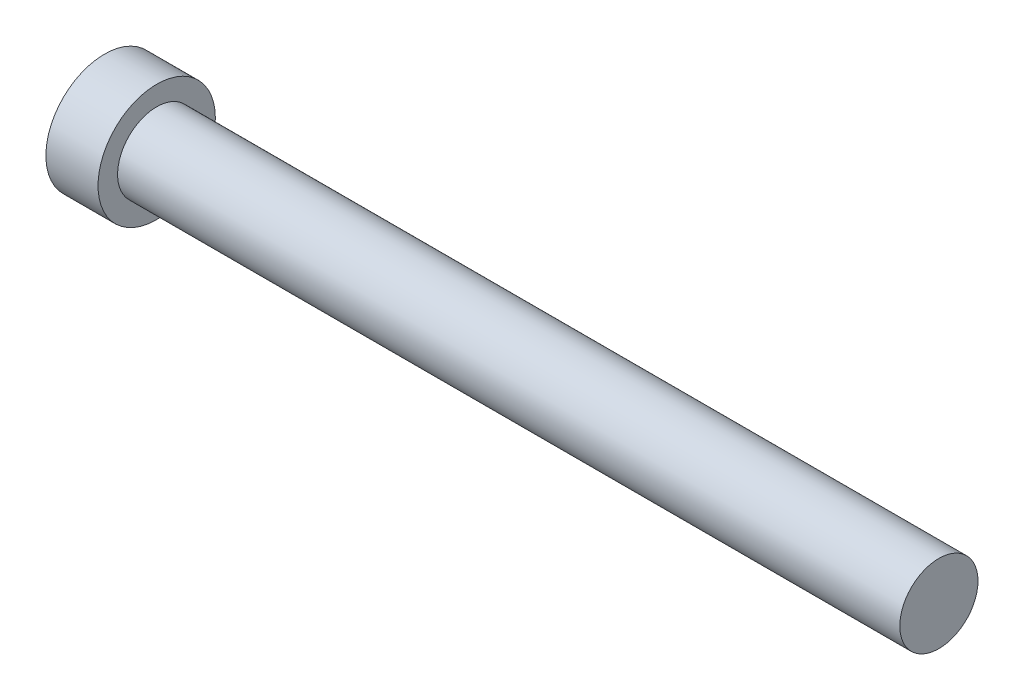
ISO-10303-21;
HEADER;
FILE_DESCRIPTION(('STEP AP214'),'2;1');
FILE_NAME('part.step','',(''),(''),'','','');
FILE_SCHEMA(('AUTOMOTIVE_DESIGN { 1 0 10303 214 1 1 1 1 }'));
ENDSEC;
DATA;
#1=APPLICATION_CONTEXT('core data for automotive mechanical design processes');
#2=APPLICATION_PROTOCOL_DEFINITION('international standard','automotive_design',2000,#1);
#3=PRODUCT_CONTEXT('',#1,'mechanical');
#4=PRODUCT('Part','Part','',(#3));
#5=PRODUCT_RELATED_PRODUCT_CATEGORY('part','',(#4));
#6=PRODUCT_DEFINITION_FORMATION('','',#4);
#7=PRODUCT_DEFINITION_CONTEXT('part definition',#1,'design');
#8=PRODUCT_DEFINITION('design','',#6,#7);
#9=PRODUCT_DEFINITION_SHAPE('','',#8);
#10=(LENGTH_UNIT() NAMED_UNIT(*) SI_UNIT(.MILLI.,.METRE.));
#11=(NAMED_UNIT(*) PLANE_ANGLE_UNIT() SI_UNIT($,.RADIAN.));
#12=(NAMED_UNIT(*) SI_UNIT($,.STERADIAN.) SOLID_ANGLE_UNIT());
#13=UNCERTAINTY_MEASURE_WITH_UNIT(LENGTH_MEASURE(1.E-05),#10,'distance_accuracy_value','');
#14=(GEOMETRIC_REPRESENTATION_CONTEXT(3) GLOBAL_UNCERTAINTY_ASSIGNED_CONTEXT((#13)) GLOBAL_UNIT_ASSIGNED_CONTEXT((#10,
#11,#12)) REPRESENTATION_CONTEXT('',''));
#15=CARTESIAN_POINT('',(0.,0.,0.));
#16=DIRECTION('',(0.,0.,1.));
#17=DIRECTION('',(1.,0.,0.));
#18=AXIS2_PLACEMENT_3D('',#15,#16,#17);
#19=CARTESIAN_POINT('',(2.,0.,0.));
#20=DIRECTION('',(-1.,0.,0.));
#21=DIRECTION('',(0.,0.,1.));
#22=AXIS2_PLACEMENT_3D('',#19,#20,#21);
#23=CYLINDRICAL_SURFACE('',#22,2.25);
#24=CARTESIAN_POINT('',(2.,0.,0.));
#25=DIRECTION('',(1.,0.,0.));
#26=DIRECTION('',(0.,0.,-1.));
#27=AXIS2_PLACEMENT_3D('',#24,#25,#26);
#28=CIRCLE('',#27,2.25);
#29=CARTESIAN_POINT('',(2.,0.,-2.25));
#30=VERTEX_POINT('',#29);
#31=EDGE_CURVE('E39',#30,#30,#28,.T.);
#32=ORIENTED_EDGE('',*,*,#31,.F.);
#33=EDGE_LOOP('',(#32));
#34=FACE_BOUND('',#33,.T.);
#35=CARTESIAN_POINT('',(0.,0.,0.));
#36=DIRECTION('',(1.,0.,0.));
#37=DIRECTION('',(0.,0.,-1.));
#38=AXIS2_PLACEMENT_3D('',#35,#36,#37);
#39=CIRCLE('',#38,2.25);
#40=CARTESIAN_POINT('',(0.,0.,-2.25));
#41=VERTEX_POINT('',#40);
#42=EDGE_CURVE('E35',#41,#41,#39,.T.);
#43=ORIENTED_EDGE('',*,*,#42,.T.);
#44=EDGE_LOOP('',(#43));
#45=FACE_BOUND('',#44,.T.);
#46=ADVANCED_FACE('F32',(#34,#45),#23,.T.);
#47=CARTESIAN_POINT('',(2.,0.,0.));
#48=DIRECTION('',(1.,0.,0.));
#49=DIRECTION('',(0.,0.,-1.));
#50=AXIS2_PLACEMENT_3D('',#47,#48,#49);
#51=PLANE('',#50);
#52=CARTESIAN_POINT('',(2.,0.,0.));
#53=DIRECTION('',(1.,0.,0.));
#54=DIRECTION('',(0.,0.,-1.));
#55=AXIS2_PLACEMENT_3D('',#52,#53,#54);
#56=CIRCLE('',#55,1.5);
#57=CARTESIAN_POINT('',(2.,0.,-1.5));
#58=VERTEX_POINT('',#57);
#59=EDGE_CURVE('E10',#58,#58,#56,.T.);
#60=ORIENTED_EDGE('',*,*,#59,.F.);
#61=EDGE_LOOP('',(#60));
#62=FACE_BOUND('',#61,.T.);
#63=ORIENTED_EDGE('',*,*,#31,.T.);
#64=EDGE_LOOP('',(#63));
#65=FACE_BOUND('',#64,.T.);
#66=ADVANCED_FACE('F56',(#62,#65),#51,.T.);
#67=CARTESIAN_POINT('',(0.,0.,0.));
#68=DIRECTION('',(1.,0.,0.));
#69=DIRECTION('',(0.,0.,-1.));
#70=AXIS2_PLACEMENT_3D('',#67,#68,#69);
#71=PLANE('',#70);
#72=ORIENTED_EDGE('',*,*,#42,.F.);
#73=EDGE_LOOP('',(#72));
#74=FACE_BOUND('',#73,.T.);
#75=ADVANCED_FACE('F53',(#74),#71,.F.);
#76=CARTESIAN_POINT('',(32.,0.,0.));
#77=DIRECTION('',(-1.,0.,0.));
#78=DIRECTION('',(0.,0.,1.));
#79=AXIS2_PLACEMENT_3D('',#76,#77,#78);
#80=CYLINDRICAL_SURFACE('',#79,1.5);
#81=CARTESIAN_POINT('',(32.,0.,0.));
#82=DIRECTION('',(1.,0.,0.));
#83=DIRECTION('',(0.,0.,-1.));
#84=AXIS2_PLACEMENT_3D('',#81,#82,#83);
#85=CIRCLE('',#84,1.5);
#86=CARTESIAN_POINT('',(32.,0.,-1.5));
#87=VERTEX_POINT('',#86);
#88=EDGE_CURVE('E45',#87,#87,#85,.T.);
#89=ORIENTED_EDGE('',*,*,#88,.F.);
#90=EDGE_LOOP('',(#89));
#91=FACE_BOUND('',#90,.T.);
#92=ORIENTED_EDGE('',*,*,#59,.T.);
#93=EDGE_LOOP('',(#92));
#94=FACE_BOUND('',#93,.T.);
#95=ADVANCED_FACE('F55',(#91,#94),#80,.T.);
#96=CARTESIAN_POINT('',(32.,0.,0.));
#97=DIRECTION('',(1.,0.,0.));
#98=DIRECTION('',(0.,0.,-1.));
#99=AXIS2_PLACEMENT_3D('',#96,#97,#98);
#100=PLANE('',#99);
#101=ORIENTED_EDGE('',*,*,#88,.T.);
#102=EDGE_LOOP('',(#101));
#103=FACE_BOUND('',#102,.T.);
#104=ADVANCED_FACE('F61',(#103),#100,.T.);
#105=CLOSED_SHELL('',(#46,#66,#75,#95,#104));
#106=MANIFOLD_SOLID_BREP('B2',#105);
#107=ADVANCED_BREP_SHAPE_REPRESENTATION('',(#18,#106),#14);
#108=SHAPE_DEFINITION_REPRESENTATION(#9,#107);
ENDSEC;
END-ISO-10303-21;
